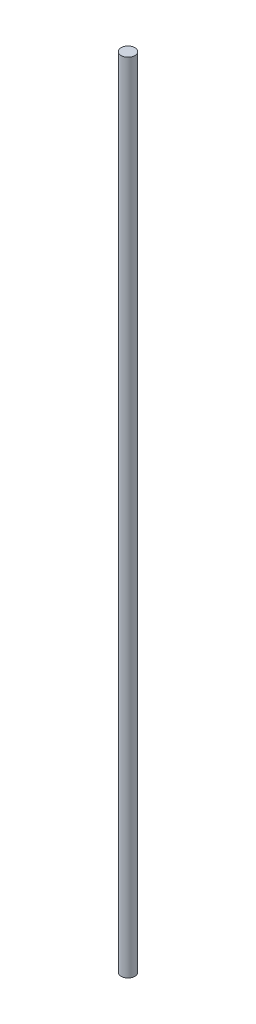
ISO-10303-21;
HEADER;
FILE_DESCRIPTION(('STEP AP214'),'2;1');
FILE_NAME('part.step','',(''),(''),'','','');
FILE_SCHEMA(('AUTOMOTIVE_DESIGN { 1 0 10303 214 1 1 1 1 }'));
ENDSEC;
DATA;
#1=APPLICATION_CONTEXT('core data for automotive mechanical design processes');
#2=APPLICATION_PROTOCOL_DEFINITION('international standard','automotive_design',2000,#1);
#3=PRODUCT_CONTEXT('',#1,'mechanical');
#4=PRODUCT('Part','Part','',(#3));
#5=PRODUCT_RELATED_PRODUCT_CATEGORY('part','',(#4));
#6=PRODUCT_DEFINITION_FORMATION('','',#4);
#7=PRODUCT_DEFINITION_CONTEXT('part definition',#1,'design');
#8=PRODUCT_DEFINITION('design','',#6,#7);
#9=PRODUCT_DEFINITION_SHAPE('','',#8);
#10=(LENGTH_UNIT() NAMED_UNIT(*) SI_UNIT(.MILLI.,.METRE.));
#11=(NAMED_UNIT(*) PLANE_ANGLE_UNIT() SI_UNIT($,.RADIAN.));
#12=(NAMED_UNIT(*) SI_UNIT($,.STERADIAN.) SOLID_ANGLE_UNIT());
#13=UNCERTAINTY_MEASURE_WITH_UNIT(LENGTH_MEASURE(1.E-05),#10,'distance_accuracy_value','');
#14=(GEOMETRIC_REPRESENTATION_CONTEXT(3) GLOBAL_UNCERTAINTY_ASSIGNED_CONTEXT((#13)) GLOBAL_UNIT_ASSIGNED_CONTEXT((#10,
#11,#12)) REPRESENTATION_CONTEXT('',''));
#15=CARTESIAN_POINT('',(0.,0.,0.));
#16=DIRECTION('',(0.,0.,1.));
#17=DIRECTION('',(1.,0.,0.));
#18=AXIS2_PLACEMENT_3D('',#15,#16,#17);
#19=CARTESIAN_POINT('',(0.,347.2,0.));
#20=DIRECTION('',(0.,-1.,0.));
#21=DIRECTION('',(0.,0.,-1.));
#22=AXIS2_PLACEMENT_3D('',#19,#20,#21);
#23=CYLINDRICAL_SURFACE('',#22,3.);
#24=CARTESIAN_POINT('',(0.,347.2,0.));
#25=DIRECTION('',(0.,1.,0.));
#26=DIRECTION('',(0.,0.,1.));
#27=AXIS2_PLACEMENT_3D('',#24,#25,#26);
#28=CIRCLE('',#27,3.);
#29=CARTESIAN_POINT('',(0.,347.2,3.));
#30=VERTEX_POINT('',#29);
#31=EDGE_CURVE('E10',#30,#30,#28,.T.);
#32=ORIENTED_EDGE('',*,*,#31,.F.);
#33=EDGE_LOOP('',(#32));
#34=FACE_BOUND('',#33,.T.);
#35=CARTESIAN_POINT('',(0.,0.,0.));
#36=DIRECTION('',(0.,1.,0.));
#37=DIRECTION('',(0.,0.,1.));
#38=AXIS2_PLACEMENT_3D('',#35,#36,#37);
#39=CIRCLE('',#38,3.);
#40=CARTESIAN_POINT('',(0.,0.,3.));
#41=VERTEX_POINT('',#40);
#42=EDGE_CURVE('E40',#41,#41,#39,.T.);
#43=ORIENTED_EDGE('',*,*,#42,.T.);
#44=EDGE_LOOP('',(#43));
#45=FACE_BOUND('',#44,.T.);
#46=ADVANCED_FACE('F37',(#34,#45),#23,.T.);
#47=CARTESIAN_POINT('',(0.,347.2,0.));
#48=DIRECTION('',(0.,1.,0.));
#49=DIRECTION('',(0.,0.,1.));
#50=AXIS2_PLACEMENT_3D('',#47,#48,#49);
#51=PLANE('',#50);
#52=ORIENTED_EDGE('',*,*,#31,.T.);
#53=EDGE_LOOP('',(#52));
#54=FACE_BOUND('',#53,.T.);
#55=ADVANCED_FACE('F54',(#54),#51,.T.);
#56=CARTESIAN_POINT('',(0.,0.,0.));
#57=DIRECTION('',(0.,1.,0.));
#58=DIRECTION('',(0.,0.,1.));
#59=AXIS2_PLACEMENT_3D('',#56,#57,#58);
#60=PLANE('',#59);
#61=ORIENTED_EDGE('',*,*,#42,.F.);
#62=EDGE_LOOP('',(#61));
#63=FACE_BOUND('',#62,.T.);
#64=ADVANCED_FACE('F52',(#63),#60,.F.);
#65=CLOSED_SHELL('',(#46,#55,#64));
#66=MANIFOLD_SOLID_BREP('B2',#65);
#67=ADVANCED_BREP_SHAPE_REPRESENTATION('',(#18,#66),#14);
#68=SHAPE_DEFINITION_REPRESENTATION(#9,#67);
ENDSEC;
END-ISO-10303-21;
